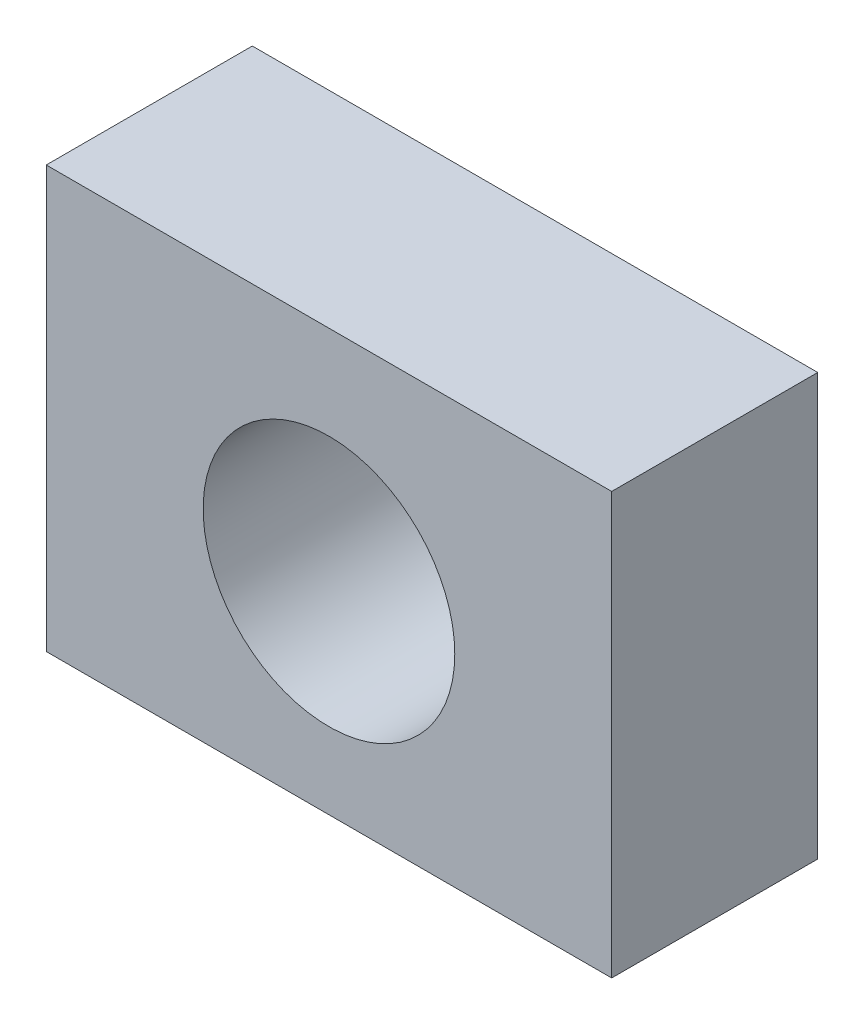
ISO-10303-21;
HEADER;
FILE_DESCRIPTION(('STEP AP214'),'2;1');
FILE_NAME('part.step','',(''),(''),'','','');
FILE_SCHEMA(('AUTOMOTIVE_DESIGN { 1 0 10303 214 1 1 1 1 }'));
ENDSEC;
DATA;
#1=APPLICATION_CONTEXT('core data for automotive mechanical design processes');
#2=APPLICATION_PROTOCOL_DEFINITION('international standard','automotive_design',2000,#1);
#3=PRODUCT_CONTEXT('',#1,'mechanical');
#4=PRODUCT('Part','Part','',(#3));
#5=PRODUCT_RELATED_PRODUCT_CATEGORY('part','',(#4));
#6=PRODUCT_DEFINITION_FORMATION('','',#4);
#7=PRODUCT_DEFINITION_CONTEXT('part definition',#1,'design');
#8=PRODUCT_DEFINITION('design','',#6,#7);
#9=PRODUCT_DEFINITION_SHAPE('','',#8);
#10=(LENGTH_UNIT() NAMED_UNIT(*) SI_UNIT(.MILLI.,.METRE.));
#11=(NAMED_UNIT(*) PLANE_ANGLE_UNIT() SI_UNIT($,.RADIAN.));
#12=(NAMED_UNIT(*) SI_UNIT($,.STERADIAN.) SOLID_ANGLE_UNIT());
#13=UNCERTAINTY_MEASURE_WITH_UNIT(LENGTH_MEASURE(1.E-05),#10,'distance_accuracy_value','');
#14=(GEOMETRIC_REPRESENTATION_CONTEXT(3) GLOBAL_UNCERTAINTY_ASSIGNED_CONTEXT((#13)) GLOBAL_UNIT_ASSIGNED_CONTEXT((#10,
#11,#12)) REPRESENTATION_CONTEXT('',''));
#15=CARTESIAN_POINT('',(0.,0.,0.));
#16=DIRECTION('',(0.,0.,1.));
#17=DIRECTION('',(1.,0.,0.));
#18=AXIS2_PLACEMENT_3D('',#15,#16,#17);
#19=CARTESIAN_POINT('',(-31.1704186175716,-24.5189903770019,25.));
#20=DIRECTION('',(0.,0.,1.));
#21=DIRECTION('',(1.,0.,0.));
#22=AXIS2_PLACEMENT_3D('',#19,#20,#21);
#23=PLANE('',#22);
#24=DIRECTION('',(0.,-1.,0.));
#25=VECTOR('',#24,1.);
#26=CARTESIAN_POINT('',(-31.1704186175716,26.6057129622787,25.));
#27=LINE('',#26,#25);
#28=CARTESIAN_POINT('',(-31.1704186175716,26.6057129622787,25.));
#29=VERTEX_POINT('',#28);
#30=CARTESIAN_POINT('',(-31.1704186175716,-24.5189903770019,25.));
#31=VERTEX_POINT('',#30);
#32=EDGE_CURVE('E85',#29,#31,#27,.T.);
#33=ORIENTED_EDGE('',*,*,#32,.T.);
#34=DIRECTION('',(1.,0.,0.));
#35=VECTOR('',#34,1.);
#36=CARTESIAN_POINT('',(-31.1704186175716,-24.5189903770019,25.));
#37=LINE('',#36,#35);
#38=CARTESIAN_POINT('',(37.4305863734019,-24.5189903770019,25.));
#39=VERTEX_POINT('',#38);
#40=EDGE_CURVE('E80',#31,#39,#37,.T.);
#41=ORIENTED_EDGE('',*,*,#40,.T.);
#42=DIRECTION('',(0.,1.,0.));
#43=VECTOR('',#42,1.);
#44=CARTESIAN_POINT('',(37.4305863734019,26.6057129622787,25.));
#45=LINE('',#44,#43);
#46=CARTESIAN_POINT('',(37.4305863734019,26.6057129622787,25.));
#47=VERTEX_POINT('',#46);
#48=EDGE_CURVE('E83',#39,#47,#45,.T.);
#49=ORIENTED_EDGE('',*,*,#48,.T.);
#50=DIRECTION('',(-1.,0.,0.));
#51=VECTOR('',#50,1.);
#52=CARTESIAN_POINT('',(-31.1704186175716,26.6057129622787,25.));
#53=LINE('',#52,#51);
#54=EDGE_CURVE('E50',#47,#29,#53,.T.);
#55=ORIENTED_EDGE('',*,*,#54,.T.);
#56=EDGE_LOOP('',(#33,#41,#49,#55));
#57=FACE_BOUND('',#56,.T.);
#58=CARTESIAN_POINT('',(3.13008387791516,0.,25.));
#59=DIRECTION('',(0.,0.,1.));
#60=DIRECTION('',(1.,0.,0.));
#61=AXIS2_PLACEMENT_3D('',#58,#59,#60);
#62=CIRCLE('',#61,15.2636170625254);
#63=CARTESIAN_POINT('',(18.3937009404406,0.,25.));
#64=VERTEX_POINT('',#63);
#65=EDGE_CURVE('E100',#64,#64,#62,.T.);
#66=ORIENTED_EDGE('',*,*,#65,.F.);
#67=EDGE_LOOP('',(#66));
#68=FACE_BOUND('',#67,.T.);
#69=ADVANCED_FACE('F33',(#57,#68),#23,.T.);
#70=CARTESIAN_POINT('',(-31.1704186175716,-24.5189903770019,0.));
#71=DIRECTION('',(0.,0.,1.));
#72=DIRECTION('',(1.,0.,0.));
#73=AXIS2_PLACEMENT_3D('',#70,#71,#72);
#74=PLANE('',#73);
#75=DIRECTION('',(0.,-1.,0.));
#76=VECTOR('',#75,1.);
#77=CARTESIAN_POINT('',(-31.1704186175716,26.6057129622787,0.));
#78=LINE('',#77,#76);
#79=CARTESIAN_POINT('',(-31.1704186175716,26.6057129622787,0.));
#80=VERTEX_POINT('',#79);
#81=CARTESIAN_POINT('',(-31.1704186175716,-24.5189903770019,0.));
#82=VERTEX_POINT('',#81);
#83=EDGE_CURVE('E97',#80,#82,#78,.T.);
#84=ORIENTED_EDGE('',*,*,#83,.F.);
#85=DIRECTION('',(-1.,0.,0.));
#86=VECTOR('',#85,1.);
#87=CARTESIAN_POINT('',(-31.1704186175716,26.6057129622787,0.));
#88=LINE('',#87,#86);
#89=CARTESIAN_POINT('',(37.4305863734019,26.6057129622787,0.));
#90=VERTEX_POINT('',#89);
#91=EDGE_CURVE('E73',#90,#80,#88,.T.);
#92=ORIENTED_EDGE('',*,*,#91,.F.);
#93=DIRECTION('',(0.,1.,0.));
#94=VECTOR('',#93,1.);
#95=CARTESIAN_POINT('',(37.4305863734019,26.6057129622787,0.));
#96=LINE('',#95,#94);
#97=CARTESIAN_POINT('',(37.4305863734019,-24.5189903770019,0.));
#98=VERTEX_POINT('',#97);
#99=EDGE_CURVE('E67',#98,#90,#96,.T.);
#100=ORIENTED_EDGE('',*,*,#99,.F.);
#101=DIRECTION('',(1.,0.,0.));
#102=VECTOR('',#101,1.);
#103=CARTESIAN_POINT('',(-31.1704186175716,-24.5189903770019,0.));
#104=LINE('',#103,#102);
#105=EDGE_CURVE('E89',#82,#98,#104,.T.);
#106=ORIENTED_EDGE('',*,*,#105,.F.);
#107=EDGE_LOOP('',(#84,#92,#100,#106));
#108=FACE_BOUND('',#107,.T.);
#109=CARTESIAN_POINT('',(3.13008387791516,0.,0.));
#110=DIRECTION('',(0.,0.,1.));
#111=DIRECTION('',(1.,0.,0.));
#112=AXIS2_PLACEMENT_3D('',#109,#110,#111);
#113=CIRCLE('',#112,15.2636170625254);
#114=CARTESIAN_POINT('',(18.3937009404406,0.,0.));
#115=VERTEX_POINT('',#114);
#116=EDGE_CURVE('E112',#115,#115,#113,.T.);
#117=ORIENTED_EDGE('',*,*,#116,.T.);
#118=EDGE_LOOP('',(#117));
#119=FACE_BOUND('',#118,.T.);
#120=ADVANCED_FACE('F108',(#108,#119),#74,.F.);
#121=CARTESIAN_POINT('',(-31.1704186175716,26.6057129622787,25.));
#122=DIRECTION('',(1.,0.,0.));
#123=DIRECTION('',(0.,0.,-1.));
#124=AXIS2_PLACEMENT_3D('',#121,#122,#123);
#125=PLANE('',#124);
#126=ORIENTED_EDGE('',*,*,#83,.T.);
#127=DIRECTION('',(0.,0.,-1.));
#128=VECTOR('',#127,1.);
#129=CARTESIAN_POINT('',(-31.1704186175716,-24.5189903770019,25.));
#130=LINE('',#129,#128);
#131=EDGE_CURVE('E11',#31,#82,#130,.T.);
#132=ORIENTED_EDGE('',*,*,#131,.F.);
#133=ORIENTED_EDGE('',*,*,#32,.F.);
#134=DIRECTION('',(0.,0.,-1.));
#135=VECTOR('',#134,1.);
#136=CARTESIAN_POINT('',(-31.1704186175716,26.6057129622787,25.));
#137=LINE('',#136,#135);
#138=EDGE_CURVE('E93',#29,#80,#137,.T.);
#139=ORIENTED_EDGE('',*,*,#138,.T.);
#140=EDGE_LOOP('',(#126,#132,#133,#139));
#141=FACE_BOUND('',#140,.T.);
#142=ADVANCED_FACE('F35',(#141),#125,.F.);
#143=CARTESIAN_POINT('',(-31.1704186175716,-24.5189903770019,25.));
#144=DIRECTION('',(0.,1.,0.));
#145=DIRECTION('',(0.,0.,1.));
#146=AXIS2_PLACEMENT_3D('',#143,#144,#145);
#147=PLANE('',#146);
#148=ORIENTED_EDGE('',*,*,#105,.T.);
#149=DIRECTION('',(0.,0.,-1.));
#150=VECTOR('',#149,1.);
#151=CARTESIAN_POINT('',(37.4305863734019,-24.5189903770019,25.));
#152=LINE('',#151,#150);
#153=EDGE_CURVE('E42',#39,#98,#152,.T.);
#154=ORIENTED_EDGE('',*,*,#153,.F.);
#155=ORIENTED_EDGE('',*,*,#40,.F.);
#156=ORIENTED_EDGE('',*,*,#131,.T.);
#157=EDGE_LOOP('',(#148,#154,#155,#156));
#158=FACE_BOUND('',#157,.T.);
#159=ADVANCED_FACE('F88',(#158),#147,.F.);
#160=CARTESIAN_POINT('',(37.4305863734019,26.6057129622787,25.));
#161=DIRECTION('',(-1.,0.,0.));
#162=DIRECTION('',(0.,0.,1.));
#163=AXIS2_PLACEMENT_3D('',#160,#161,#162);
#164=PLANE('',#163);
#165=ORIENTED_EDGE('',*,*,#99,.T.);
#166=DIRECTION('',(0.,0.,-1.));
#167=VECTOR('',#166,1.);
#168=CARTESIAN_POINT('',(37.4305863734019,26.6057129622787,25.));
#169=LINE('',#168,#167);
#170=EDGE_CURVE('E90',#47,#90,#169,.T.);
#171=ORIENTED_EDGE('',*,*,#170,.F.);
#172=ORIENTED_EDGE('',*,*,#48,.F.);
#173=ORIENTED_EDGE('',*,*,#153,.T.);
#174=EDGE_LOOP('',(#165,#171,#172,#173));
#175=FACE_BOUND('',#174,.T.);
#176=ADVANCED_FACE('F91',(#175),#164,.F.);
#177=CARTESIAN_POINT('',(-31.1704186175716,26.6057129622787,25.));
#178=DIRECTION('',(0.,-1.,0.));
#179=DIRECTION('',(0.,0.,-1.));
#180=AXIS2_PLACEMENT_3D('',#177,#178,#179);
#181=PLANE('',#180);
#182=ORIENTED_EDGE('',*,*,#91,.T.);
#183=ORIENTED_EDGE('',*,*,#138,.F.);
#184=ORIENTED_EDGE('',*,*,#54,.F.);
#185=ORIENTED_EDGE('',*,*,#170,.T.);
#186=EDGE_LOOP('',(#182,#183,#184,#185));
#187=FACE_BOUND('',#186,.T.);
#188=ADVANCED_FACE('F105',(#187),#181,.F.);
#189=CARTESIAN_POINT('',(3.13008387791516,0.,25.));
#190=DIRECTION('',(0.,0.,-1.));
#191=DIRECTION('',(-1.,0.,0.));
#192=AXIS2_PLACEMENT_3D('',#189,#190,#191);
#193=CYLINDRICAL_SURFACE('',#192,15.2636170625254);
#194=ORIENTED_EDGE('',*,*,#65,.T.);
#195=EDGE_LOOP('',(#194));
#196=FACE_BOUND('',#195,.T.);
#197=ORIENTED_EDGE('',*,*,#116,.F.);
#198=EDGE_LOOP('',(#197));
#199=FACE_BOUND('',#198,.T.);
#200=ADVANCED_FACE('F118',(#196,#199),#193,.F.);
#201=CLOSED_SHELL('',(#69,#120,#142,#159,#176,#188,#200));
#202=MANIFOLD_SOLID_BREP('B2',#201);
#203=ADVANCED_BREP_SHAPE_REPRESENTATION('',(#18,#202),#14);
#204=SHAPE_DEFINITION_REPRESENTATION(#9,#203);
ENDSEC;
END-ISO-10303-21;
